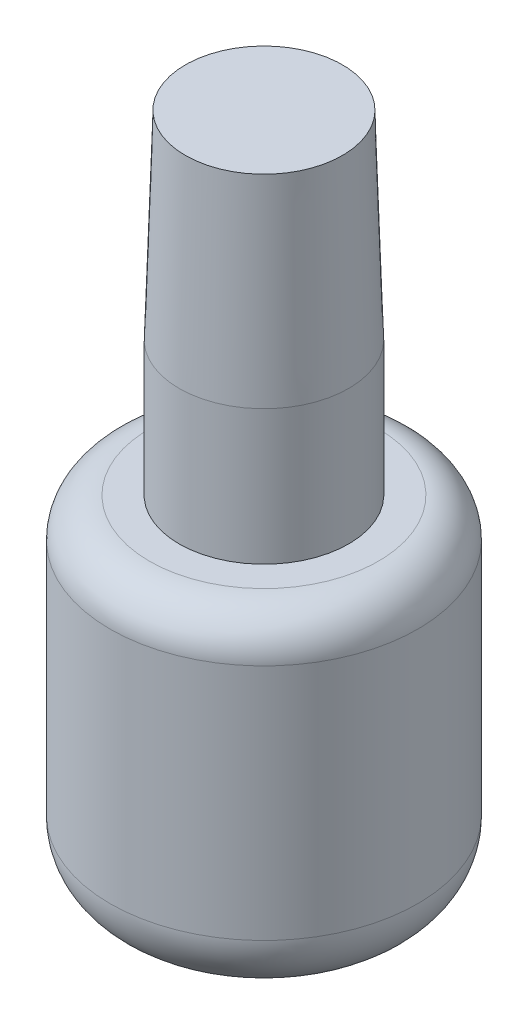
ISO-10303-21;
HEADER;
FILE_DESCRIPTION(('STEP AP214'),'2;1');
FILE_NAME('part.step','',(''),(''),'','','');
FILE_SCHEMA(('AUTOMOTIVE_DESIGN { 1 0 10303 214 1 1 1 1 }'));
ENDSEC;
DATA;
#1=APPLICATION_CONTEXT('core data for automotive mechanical design processes');
#2=APPLICATION_PROTOCOL_DEFINITION('international standard','automotive_design',2000,#1);
#3=PRODUCT_CONTEXT('',#1,'mechanical');
#4=PRODUCT('Part','Part','',(#3));
#5=PRODUCT_RELATED_PRODUCT_CATEGORY('part','',(#4));
#6=PRODUCT_DEFINITION_FORMATION('','',#4);
#7=PRODUCT_DEFINITION_CONTEXT('part definition',#1,'design');
#8=PRODUCT_DEFINITION('design','',#6,#7);
#9=PRODUCT_DEFINITION_SHAPE('','',#8);
#10=(LENGTH_UNIT() NAMED_UNIT(*) SI_UNIT(.MILLI.,.METRE.));
#11=(NAMED_UNIT(*) PLANE_ANGLE_UNIT() SI_UNIT($,.RADIAN.));
#12=(NAMED_UNIT(*) SI_UNIT($,.STERADIAN.) SOLID_ANGLE_UNIT());
#13=UNCERTAINTY_MEASURE_WITH_UNIT(LENGTH_MEASURE(1.E-05),#10,'distance_accuracy_value','');
#14=(GEOMETRIC_REPRESENTATION_CONTEXT(3) GLOBAL_UNCERTAINTY_ASSIGNED_CONTEXT((#13)) GLOBAL_UNIT_ASSIGNED_CONTEXT((#10,
#11,#12)) REPRESENTATION_CONTEXT('',''));
#15=CARTESIAN_POINT('',(0.,0.,0.));
#16=DIRECTION('',(0.,0.,1.));
#17=DIRECTION('',(1.,0.,0.));
#18=AXIS2_PLACEMENT_3D('',#15,#16,#17);
#19=CARTESIAN_POINT('',(0.,17.272,0.));
#20=DIRECTION('',(0.,1.,0.));
#21=DIRECTION('',(1.,0.,0.));
#22=AXIS2_PLACEMENT_3D('',#19,#20,#21);
#23=SPHERICAL_SURFACE('',#22,17.272);
#24=CARTESIAN_POINT('',(0.,3.50866898462118,0.));
#25=DIRECTION('',(0.,1.,0.));
#26=DIRECTION('',(0.,0.,1.));
#27=AXIS2_PLACEMENT_3D('',#24,#25,#26);
#28=CIRCLE('',#27,10.4351666666667);
#29=CARTESIAN_POINT('',(0.,3.50866898462118,10.4351666666667));
#30=VERTEX_POINT('',#29);
#31=EDGE_CURVE('E10',#30,#30,#28,.T.);
#32=ORIENTED_EDGE('',*,*,#31,.F.);
#33=EDGE_LOOP('',(#32));
#34=FACE_BOUND('',#33,.T.);
#35=ADVANCED_FACE('F49',(#34),#23,.T.);
#36=CARTESIAN_POINT('',(0.,7.55670751855612,0.));
#37=DIRECTION('',(0.,1.,0.));
#38=DIRECTION('',(0.,0.,1.));
#39=AXIS2_PLACEMENT_3D('',#36,#37,#38);
#40=TOROIDAL_SURFACE('',#39,7.366,5.08);
#41=CARTESIAN_POINT('',(0.,7.55670751855612,0.));
#42=DIRECTION('',(0.,1.,0.));
#43=DIRECTION('',(0.,0.,1.));
#44=AXIS2_PLACEMENT_3D('',#41,#42,#43);
#45=CIRCLE('',#44,12.446);
#46=CARTESIAN_POINT('',(0.,7.55670751855612,12.446));
#47=VERTEX_POINT('',#46);
#48=EDGE_CURVE('E56',#47,#47,#45,.T.);
#49=ORIENTED_EDGE('',*,*,#48,.F.);
#50=EDGE_LOOP('',(#49));
#51=FACE_BOUND('',#50,.T.);
#52=ORIENTED_EDGE('',*,*,#31,.T.);
#53=EDGE_LOOP('',(#52));
#54=FACE_BOUND('',#53,.T.);
#55=ADVANCED_FACE('F113',(#51,#54),#40,.T.);
#56=CARTESIAN_POINT('',(0.,56.9468,0.));
#57=DIRECTION('',(0.,1.,0.));
#58=DIRECTION('',(0.,0.,1.));
#59=AXIS2_PLACEMENT_3D('',#56,#57,#58);
#60=CYLINDRICAL_SURFACE('',#59,12.446);
#61=CARTESIAN_POINT('',(0.,26.797,0.));
#62=DIRECTION('',(0.,1.,0.));
#63=DIRECTION('',(0.,0.,1.));
#64=AXIS2_PLACEMENT_3D('',#61,#62,#63);
#65=CIRCLE('',#64,12.446);
#66=CARTESIAN_POINT('',(0.,26.797,12.446));
#67=VERTEX_POINT('',#66);
#68=EDGE_CURVE('E61',#67,#67,#65,.T.);
#69=ORIENTED_EDGE('',*,*,#68,.F.);
#70=EDGE_LOOP('',(#69));
#71=FACE_BOUND('',#70,.T.);
#72=ORIENTED_EDGE('',*,*,#48,.T.);
#73=EDGE_LOOP('',(#72));
#74=FACE_BOUND('',#73,.T.);
#75=ADVANCED_FACE('F108',(#71,#74),#60,.T.);
#76=CARTESIAN_POINT('',(0.,26.797,0.));
#77=DIRECTION('',(0.,1.,0.));
#78=DIRECTION('',(0.,0.,1.));
#79=AXIS2_PLACEMENT_3D('',#76,#77,#78);
#80=TOROIDAL_SURFACE('',#79,9.271,3.175);
#81=CARTESIAN_POINT('',(0.,29.972,0.));
#82=DIRECTION('',(0.,1.,0.));
#83=DIRECTION('',(0.,0.,1.));
#84=AXIS2_PLACEMENT_3D('',#81,#82,#83);
#85=CIRCLE('',#84,9.271);
#86=CARTESIAN_POINT('',(0.,29.972,9.271));
#87=VERTEX_POINT('',#86);
#88=EDGE_CURVE('E66',#87,#87,#85,.T.);
#89=ORIENTED_EDGE('',*,*,#88,.F.);
#90=EDGE_LOOP('',(#89));
#91=FACE_BOUND('',#90,.T.);
#92=ORIENTED_EDGE('',*,*,#68,.T.);
#93=EDGE_LOOP('',(#92));
#94=FACE_BOUND('',#93,.T.);
#95=ADVANCED_FACE('F102',(#91,#94),#80,.T.);
#96=CARTESIAN_POINT('',(9.271,29.972,0.));
#97=DIRECTION('',(0.,-1.,0.));
#98=DIRECTION('',(0.,0.,-1.));
#99=AXIS2_PLACEMENT_3D('',#96,#97,#98);
#100=PLANE('',#99);
#101=CARTESIAN_POINT('',(0.,29.972,0.));
#102=DIRECTION('',(0.,1.,0.));
#103=DIRECTION('',(0.,0.,1.));
#104=AXIS2_PLACEMENT_3D('',#101,#102,#103);
#105=CIRCLE('',#104,6.858);
#106=CARTESIAN_POINT('',(0.,29.972,6.858));
#107=VERTEX_POINT('',#106);
#108=EDGE_CURVE('E72',#107,#107,#105,.T.);
#109=ORIENTED_EDGE('',*,*,#108,.F.);
#110=EDGE_LOOP('',(#109));
#111=FACE_BOUND('',#110,.T.);
#112=ORIENTED_EDGE('',*,*,#88,.T.);
#113=EDGE_LOOP('',(#112));
#114=FACE_BOUND('',#113,.T.);
#115=ADVANCED_FACE('F96',(#111,#114),#100,.F.);
#116=CARTESIAN_POINT('',(0.,56.9468,0.));
#117=DIRECTION('',(0.,1.,0.));
#118=DIRECTION('',(0.,0.,1.));
#119=AXIS2_PLACEMENT_3D('',#116,#117,#118);
#120=CYLINDRICAL_SURFACE('',#119,6.858);
#121=CARTESIAN_POINT('',(0.,40.8686,0.));
#122=DIRECTION('',(0.,1.,0.));
#123=DIRECTION('',(0.,0.,1.));
#124=AXIS2_PLACEMENT_3D('',#121,#122,#123);
#125=CIRCLE('',#124,6.858);
#126=CARTESIAN_POINT('',(0.,40.8686,6.858));
#127=VERTEX_POINT('',#126);
#128=EDGE_CURVE('E76',#127,#127,#125,.T.);
#129=ORIENTED_EDGE('',*,*,#128,.F.);
#130=EDGE_LOOP('',(#129));
#131=FACE_BOUND('',#130,.T.);
#132=ORIENTED_EDGE('',*,*,#108,.T.);
#133=EDGE_LOOP('',(#132));
#134=FACE_BOUND('',#133,.T.);
#135=ADVANCED_FACE('F90',(#131,#134),#120,.T.);
#136=CARTESIAN_POINT('',(0.,40.8686,0.));
#137=DIRECTION('',(0.,-1.,0.));
#138=DIRECTION('',(0.,0.,-1.));
#139=AXIS2_PLACEMENT_3D('',#136,#137,#138);
#140=CONICAL_SURFACE('',#139,6.858,0.0312413936106986);
#141=CARTESIAN_POINT('',(0.,56.9468,0.));
#142=DIRECTION('',(0.,1.,0.));
#143=DIRECTION('',(0.,0.,1.));
#144=AXIS2_PLACEMENT_3D('',#141,#142,#143);
#145=CIRCLE('',#144,6.35553114060882);
#146=CARTESIAN_POINT('',(0.,56.9468,6.35553114060882));
#147=VERTEX_POINT('',#146);
#148=EDGE_CURVE('E80',#147,#147,#145,.T.);
#149=ORIENTED_EDGE('',*,*,#148,.F.);
#150=EDGE_LOOP('',(#149));
#151=FACE_BOUND('',#150,.T.);
#152=ORIENTED_EDGE('',*,*,#128,.T.);
#153=EDGE_LOOP('',(#152));
#154=FACE_BOUND('',#153,.T.);
#155=ADVANCED_FACE('F87',(#151,#154),#140,.T.);
#156=CARTESIAN_POINT('',(6.35553114060882,56.9468,0.));
#157=DIRECTION('',(0.,-1.,0.));
#158=DIRECTION('',(0.,0.,-1.));
#159=AXIS2_PLACEMENT_3D('',#156,#157,#158);
#160=PLANE('',#159);
#161=ORIENTED_EDGE('',*,*,#148,.T.);
#162=EDGE_LOOP('',(#161));
#163=FACE_BOUND('',#162,.T.);
#164=ADVANCED_FACE('F85',(#163),#160,.F.);
#165=CLOSED_SHELL('',(#35,#55,#75,#95,#115,#135,#155,#164));
#166=MANIFOLD_SOLID_BREP('B2',#165);
#167=ADVANCED_BREP_SHAPE_REPRESENTATION('',(#18,#166),#14);
#168=SHAPE_DEFINITION_REPRESENTATION(#9,#167);
ENDSEC;
END-ISO-10303-21;
